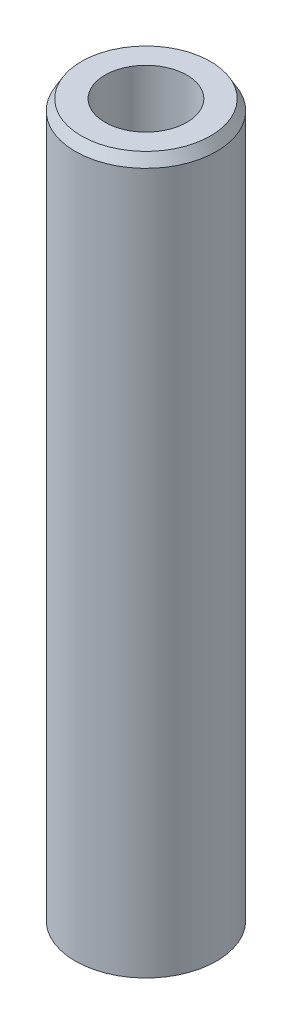
ISO-10303-21;
HEADER;
FILE_DESCRIPTION(('STEP AP214'),'2;1');
FILE_NAME('part.step','',(''),(''),'','','');
FILE_SCHEMA(('AUTOMOTIVE_DESIGN { 1 0 10303 214 1 1 1 1 }'));
ENDSEC;
DATA;
#1=APPLICATION_CONTEXT('core data for automotive mechanical design processes');
#2=APPLICATION_PROTOCOL_DEFINITION('international standard','automotive_design',2000,#1);
#3=PRODUCT_CONTEXT('',#1,'mechanical');
#4=PRODUCT('Part','Part','',(#3));
#5=PRODUCT_RELATED_PRODUCT_CATEGORY('part','',(#4));
#6=PRODUCT_DEFINITION_FORMATION('','',#4);
#7=PRODUCT_DEFINITION_CONTEXT('part definition',#1,'design');
#8=PRODUCT_DEFINITION('design','',#6,#7);
#9=PRODUCT_DEFINITION_SHAPE('','',#8);
#10=(LENGTH_UNIT() NAMED_UNIT(*) SI_UNIT(.MILLI.,.METRE.));
#11=(NAMED_UNIT(*) PLANE_ANGLE_UNIT() SI_UNIT($,.RADIAN.));
#12=(NAMED_UNIT(*) SI_UNIT($,.STERADIAN.) SOLID_ANGLE_UNIT());
#13=UNCERTAINTY_MEASURE_WITH_UNIT(LENGTH_MEASURE(1.E-05),#10,'distance_accuracy_value','');
#14=(GEOMETRIC_REPRESENTATION_CONTEXT(3) GLOBAL_UNCERTAINTY_ASSIGNED_CONTEXT((#13)) GLOBAL_UNIT_ASSIGNED_CONTEXT((#10,
#11,#12)) REPRESENTATION_CONTEXT('',''));
#15=CARTESIAN_POINT('',(0.,0.,0.));
#16=DIRECTION('',(0.,0.,1.));
#17=DIRECTION('',(1.,0.,0.));
#18=AXIS2_PLACEMENT_3D('',#15,#16,#17);
#19=CARTESIAN_POINT('',(0.,228.812717960038,0.));
#20=DIRECTION('',(0.,-1.,0.));
#21=DIRECTION('',(0.,0.,-1.));
#22=AXIS2_PLACEMENT_3D('',#19,#20,#21);
#23=CYLINDRICAL_SURFACE('',#22,22.5);
#24=CARTESIAN_POINT('',(0.,225.483348022385,0.));
#25=DIRECTION('',(0.,1.,0.));
#26=DIRECTION('',(0.,0.,1.));
#27=AXIS2_PLACEMENT_3D('',#24,#25,#26);
#28=CIRCLE('',#27,22.5);
#29=CARTESIAN_POINT('',(0.,225.483348022385,22.5));
#30=VERTEX_POINT('',#29);
#31=EDGE_CURVE('E50',#30,#30,#28,.F.);
#32=ORIENTED_EDGE('',*,*,#31,.T.);
#33=EDGE_LOOP('',(#32));
#34=FACE_BOUND('',#33,.T.);
#35=CARTESIAN_POINT('',(0.,1.92221262973588,0.));
#36=DIRECTION('',(0.,1.,0.));
#37=DIRECTION('',(0.,0.,1.));
#38=AXIS2_PLACEMENT_3D('',#35,#36,#37);
#39=CIRCLE('',#38,22.5);
#40=CARTESIAN_POINT('',(0.,1.92221262973588,22.5));
#41=VERTEX_POINT('',#40);
#42=EDGE_CURVE('E51',#41,#41,#39,.T.);
#43=ORIENTED_EDGE('',*,*,#42,.T.);
#44=EDGE_LOOP('',(#43));
#45=FACE_BOUND('',#44,.T.);
#46=ADVANCED_FACE('F39',(#34,#45),#23,.T.);
#47=CARTESIAN_POINT('',(0.,228.812717960038,0.));
#48=DIRECTION('',(0.,1.,0.));
#49=DIRECTION('',(0.,0.,1.));
#50=AXIS2_PLACEMENT_3D('',#47,#48,#49);
#51=PLANE('',#50);
#52=CARTESIAN_POINT('',(0.,228.812717960038,0.));
#53=DIRECTION('',(0.,1.,0.));
#54=DIRECTION('',(0.,0.,1.));
#55=AXIS2_PLACEMENT_3D('',#52,#53,#54);
#56=CIRCLE('',#55,20.5777873702641);
#57=CARTESIAN_POINT('',(0.,228.812717960038,20.5777873702641));
#58=VERTEX_POINT('',#57);
#59=EDGE_CURVE('E54',#58,#58,#56,.T.);
#60=ORIENTED_EDGE('',*,*,#59,.T.);
#61=EDGE_LOOP('',(#60));
#62=FACE_BOUND('',#61,.T.);
#63=CARTESIAN_POINT('',(0.,228.812717960038,0.));
#64=DIRECTION('',(0.,1.,0.));
#65=DIRECTION('',(0.,0.,1.));
#66=AXIS2_PLACEMENT_3D('',#63,#64,#65);
#67=CIRCLE('',#66,13.0581791767083);
#68=CARTESIAN_POINT('',(0.,228.812717960038,13.0581791767083));
#69=VERTEX_POINT('',#68);
#70=EDGE_CURVE('E58',#69,#69,#67,.T.);
#71=ORIENTED_EDGE('',*,*,#70,.F.);
#72=EDGE_LOOP('',(#71));
#73=FACE_BOUND('',#72,.T.);
#74=ADVANCED_FACE('F69',(#62,#73),#51,.T.);
#75=CARTESIAN_POINT('',(0.,0.,0.));
#76=DIRECTION('',(0.,1.,0.));
#77=DIRECTION('',(0.,0.,1.));
#78=AXIS2_PLACEMENT_3D('',#75,#76,#77);
#79=PLANE('',#78);
#80=CARTESIAN_POINT('',(0.,0.,0.));
#81=DIRECTION('',(0.,1.,0.));
#82=DIRECTION('',(0.,0.,1.));
#83=AXIS2_PLACEMENT_3D('',#80,#81,#82);
#84=CIRCLE('',#83,19.1706300623468);
#85=CARTESIAN_POINT('',(0.,0.,19.1706300623468));
#86=VERTEX_POINT('',#85);
#87=EDGE_CURVE('E10',#86,#86,#84,.F.);
#88=ORIENTED_EDGE('',*,*,#87,.T.);
#89=EDGE_LOOP('',(#88));
#90=FACE_BOUND('',#89,.T.);
#91=CARTESIAN_POINT('',(0.,0.,0.));
#92=DIRECTION('',(0.,1.,0.));
#93=DIRECTION('',(0.,0.,1.));
#94=AXIS2_PLACEMENT_3D('',#91,#92,#93);
#95=CIRCLE('',#94,13.0581791767083);
#96=CARTESIAN_POINT('',(0.,0.,13.0581791767083));
#97=VERTEX_POINT('',#96);
#98=EDGE_CURVE('E63',#97,#97,#95,.T.);
#99=ORIENTED_EDGE('',*,*,#98,.T.);
#100=EDGE_LOOP('',(#99));
#101=FACE_BOUND('',#100,.T.);
#102=ADVANCED_FACE('F75',(#90,#101),#79,.F.);
#103=CARTESIAN_POINT('',(0.,228.812717960038,0.));
#104=DIRECTION('',(0.,-1.,0.));
#105=DIRECTION('',(0.,0.,-1.));
#106=AXIS2_PLACEMENT_3D('',#103,#104,#105);
#107=CYLINDRICAL_SURFACE('',#106,13.0581791767083);
#108=ORIENTED_EDGE('',*,*,#70,.T.);
#109=EDGE_LOOP('',(#108));
#110=FACE_BOUND('',#109,.T.);
#111=ORIENTED_EDGE('',*,*,#98,.F.);
#112=EDGE_LOOP('',(#111));
#113=FACE_BOUND('',#112,.T.);
#114=ADVANCED_FACE('F70',(#110,#113),#107,.F.);
#115=CARTESIAN_POINT('',(0.,228.812717960038,0.));
#116=DIRECTION('',(0.,-1.,0.));
#117=DIRECTION('',(0.,0.,-1.));
#118=AXIS2_PLACEMENT_3D('',#115,#116,#117);
#119=CONICAL_SURFACE('',#118,20.5777873702641,0.523598775598297);
#120=ORIENTED_EDGE('',*,*,#31,.F.);
#121=EDGE_LOOP('',(#120));
#122=FACE_BOUND('',#121,.T.);
#123=ORIENTED_EDGE('',*,*,#59,.F.);
#124=EDGE_LOOP('',(#123));
#125=FACE_BOUND('',#124,.T.);
#126=ADVANCED_FACE('F81',(#122,#125),#119,.T.);
#127=CARTESIAN_POINT('',(0.,1.92221262973588,0.));
#128=DIRECTION('',(0.,1.,0.));
#129=DIRECTION('',(0.,0.,1.));
#130=AXIS2_PLACEMENT_3D('',#127,#128,#129);
#131=CONICAL_SURFACE('',#130,22.5,1.04719755119661);
#132=ORIENTED_EDGE('',*,*,#87,.F.);
#133=EDGE_LOOP('',(#132));
#134=FACE_BOUND('',#133,.T.);
#135=ORIENTED_EDGE('',*,*,#42,.F.);
#136=EDGE_LOOP('',(#135));
#137=FACE_BOUND('',#136,.T.);
#138=ADVANCED_FACE('F45',(#134,#137),#131,.T.);
#139=CLOSED_SHELL('',(#46,#74,#102,#114,#126,#138));
#140=MANIFOLD_SOLID_BREP('B2',#139);
#141=ADVANCED_BREP_SHAPE_REPRESENTATION('',(#18,#140),#14);
#142=SHAPE_DEFINITION_REPRESENTATION(#9,#141);
ENDSEC;
END-ISO-10303-21;
